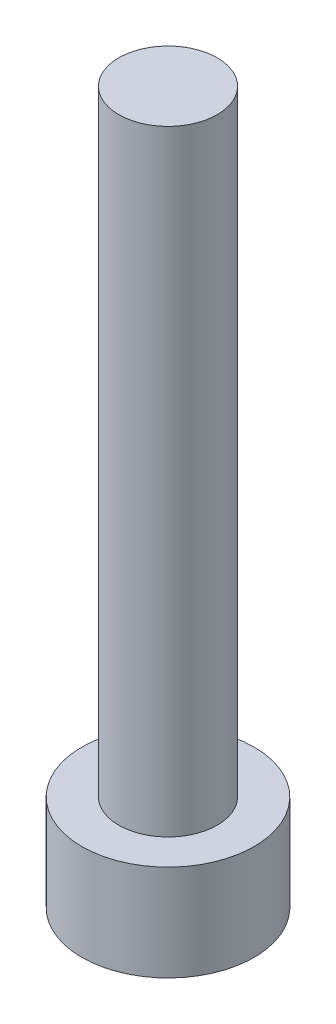
ISO-10303-21;
HEADER;
FILE_DESCRIPTION(('STEP AP214'),'2;1');
FILE_NAME('part.step','',(''),(''),'','','');
FILE_SCHEMA(('AUTOMOTIVE_DESIGN { 1 0 10303 214 1 1 1 1 }'));
ENDSEC;
DATA;
#1=APPLICATION_CONTEXT('core data for automotive mechanical design processes');
#2=APPLICATION_PROTOCOL_DEFINITION('international standard','automotive_design',2000,#1);
#3=PRODUCT_CONTEXT('',#1,'mechanical');
#4=PRODUCT('Part','Part','',(#3));
#5=PRODUCT_RELATED_PRODUCT_CATEGORY('part','',(#4));
#6=PRODUCT_DEFINITION_FORMATION('','',#4);
#7=PRODUCT_DEFINITION_CONTEXT('part definition',#1,'design');
#8=PRODUCT_DEFINITION('design','',#6,#7);
#9=PRODUCT_DEFINITION_SHAPE('','',#8);
#10=(LENGTH_UNIT() NAMED_UNIT(*) SI_UNIT(.MILLI.,.METRE.));
#11=(NAMED_UNIT(*) PLANE_ANGLE_UNIT() SI_UNIT($,.RADIAN.));
#12=(NAMED_UNIT(*) SI_UNIT($,.STERADIAN.) SOLID_ANGLE_UNIT());
#13=UNCERTAINTY_MEASURE_WITH_UNIT(LENGTH_MEASURE(1.E-05),#10,'distance_accuracy_value','');
#14=(GEOMETRIC_REPRESENTATION_CONTEXT(3) GLOBAL_UNCERTAINTY_ASSIGNED_CONTEXT((#13)) GLOBAL_UNIT_ASSIGNED_CONTEXT((#10,
#11,#12)) REPRESENTATION_CONTEXT('',''));
#15=CARTESIAN_POINT('',(0.,0.,0.));
#16=DIRECTION('',(0.,0.,1.));
#17=DIRECTION('',(1.,0.,0.));
#18=AXIS2_PLACEMENT_3D('',#15,#16,#17);
#19=CARTESIAN_POINT('',(0.,3.9,0.));
#20=DIRECTION('',(0.,-1.,0.));
#21=DIRECTION('',(0.,0.,-1.));
#22=AXIS2_PLACEMENT_3D('',#19,#20,#21);
#23=CYLINDRICAL_SURFACE('',#22,3.5);
#24=CARTESIAN_POINT('',(0.,3.9,0.));
#25=DIRECTION('',(0.,1.,0.));
#26=DIRECTION('',(0.,0.,1.));
#27=AXIS2_PLACEMENT_3D('',#24,#25,#26);
#28=CIRCLE('',#27,3.5);
#29=CARTESIAN_POINT('',(0.,3.9,3.5));
#30=VERTEX_POINT('',#29);
#31=EDGE_CURVE('E43',#30,#30,#28,.T.);
#32=ORIENTED_EDGE('',*,*,#31,.F.);
#33=EDGE_LOOP('',(#32));
#34=FACE_BOUND('',#33,.T.);
#35=CARTESIAN_POINT('',(0.,0.,0.));
#36=DIRECTION('',(0.,1.,0.));
#37=DIRECTION('',(0.,0.,1.));
#38=AXIS2_PLACEMENT_3D('',#35,#36,#37);
#39=CIRCLE('',#38,3.5);
#40=CARTESIAN_POINT('',(0.,0.,3.5));
#41=VERTEX_POINT('',#40);
#42=EDGE_CURVE('E38',#41,#41,#39,.T.);
#43=ORIENTED_EDGE('',*,*,#42,.T.);
#44=EDGE_LOOP('',(#43));
#45=FACE_BOUND('',#44,.T.);
#46=ADVANCED_FACE('F35',(#34,#45),#23,.T.);
#47=CARTESIAN_POINT('',(0.,3.9,0.));
#48=DIRECTION('',(0.,1.,0.));
#49=DIRECTION('',(0.,0.,1.));
#50=AXIS2_PLACEMENT_3D('',#47,#48,#49);
#51=PLANE('',#50);
#52=CARTESIAN_POINT('',(0.,3.9,0.));
#53=DIRECTION('',(0.,1.,0.));
#54=DIRECTION('',(0.,0.,1.));
#55=AXIS2_PLACEMENT_3D('',#52,#53,#54);
#56=CIRCLE('',#55,2.);
#57=CARTESIAN_POINT('',(0.,3.9,2.));
#58=VERTEX_POINT('',#57);
#59=EDGE_CURVE('E11',#58,#58,#56,.T.);
#60=ORIENTED_EDGE('',*,*,#59,.F.);
#61=EDGE_LOOP('',(#60));
#62=FACE_BOUND('',#61,.T.);
#63=ORIENTED_EDGE('',*,*,#31,.T.);
#64=EDGE_LOOP('',(#63));
#65=FACE_BOUND('',#64,.T.);
#66=ADVANCED_FACE('F155',(#62,#65),#51,.T.);
#67=CARTESIAN_POINT('',(0.,0.,0.));
#68=DIRECTION('',(0.,1.,0.));
#69=DIRECTION('',(0.,0.,1.));
#70=AXIS2_PLACEMENT_3D('',#67,#68,#69);
#71=PLANE('',#70);
#72=DIRECTION('',(-0.5,0.,0.866025403784438));
#73=VECTOR('',#72,1.);
#74=CARTESIAN_POINT('',(1.725,0.,0.));
#75=LINE('',#74,#73);
#76=CARTESIAN_POINT('',(1.725,0.,0.));
#77=VERTEX_POINT('',#76);
#78=CARTESIAN_POINT('',(0.862499999999999,0.,1.49389382152816));
#79=VERTEX_POINT('',#78);
#80=EDGE_CURVE('E125',#77,#79,#75,.T.);
#81=ORIENTED_EDGE('',*,*,#80,.F.);
#82=DIRECTION('',(0.5,0.,0.866025403784439));
#83=VECTOR('',#82,1.);
#84=CARTESIAN_POINT('',(0.8625,0.,-1.49389382152816));
#85=LINE('',#84,#83);
#86=CARTESIAN_POINT('',(0.8625,0.,-1.49389382152816));
#87=VERTEX_POINT('',#86);
#88=EDGE_CURVE('E51',#87,#77,#85,.T.);
#89=ORIENTED_EDGE('',*,*,#88,.F.);
#90=DIRECTION('',(1.,0.,0.));
#91=VECTOR('',#90,1.);
#92=CARTESIAN_POINT('',(-0.8625,0.,-1.49389382152816));
#93=LINE('',#92,#91);
#94=CARTESIAN_POINT('',(-0.8625,0.,-1.49389382152816));
#95=VERTEX_POINT('',#94);
#96=EDGE_CURVE('E134',#95,#87,#93,.T.);
#97=ORIENTED_EDGE('',*,*,#96,.F.);
#98=DIRECTION('',(0.5,0.,-0.866025403784439));
#99=VECTOR('',#98,1.);
#100=CARTESIAN_POINT('',(-1.725,0.,0.));
#101=LINE('',#100,#99);
#102=CARTESIAN_POINT('',(-1.725,0.,0.));
#103=VERTEX_POINT('',#102);
#104=EDGE_CURVE('E132',#103,#95,#101,.T.);
#105=ORIENTED_EDGE('',*,*,#104,.F.);
#106=DIRECTION('',(-0.5,0.,-0.866025403784439));
#107=VECTOR('',#106,1.);
#108=CARTESIAN_POINT('',(-0.8625,0.,1.49389382152816));
#109=LINE('',#108,#107);
#110=CARTESIAN_POINT('',(-0.8625,0.,1.49389382152816));
#111=VERTEX_POINT('',#110);
#112=EDGE_CURVE('E99',#111,#103,#109,.T.);
#113=ORIENTED_EDGE('',*,*,#112,.F.);
#114=DIRECTION('',(-1.,0.,0.));
#115=VECTOR('',#114,1.);
#116=CARTESIAN_POINT('',(0.862499999999999,0.,1.49389382152816));
#117=LINE('',#116,#115);
#118=EDGE_CURVE('E128',#79,#111,#117,.T.);
#119=ORIENTED_EDGE('',*,*,#118,.F.);
#120=EDGE_LOOP('',(#81,#89,#97,#105,#113,#119));
#121=FACE_BOUND('',#120,.T.);
#122=ORIENTED_EDGE('',*,*,#42,.F.);
#123=EDGE_LOOP('',(#122));
#124=FACE_BOUND('',#123,.T.);
#125=ADVANCED_FACE('F152',(#121,#124),#71,.F.);
#126=CARTESIAN_POINT('',(0.,28.9,0.));
#127=DIRECTION('',(0.,-1.,0.));
#128=DIRECTION('',(0.,0.,-1.));
#129=AXIS2_PLACEMENT_3D('',#126,#127,#128);
#130=CYLINDRICAL_SURFACE('',#129,2.);
#131=CARTESIAN_POINT('',(0.,28.9,0.));
#132=DIRECTION('',(0.,1.,0.));
#133=DIRECTION('',(0.,0.,1.));
#134=AXIS2_PLACEMENT_3D('',#131,#132,#133);
#135=CIRCLE('',#134,2.);
#136=CARTESIAN_POINT('',(0.,28.9,2.));
#137=VERTEX_POINT('',#136);
#138=EDGE_CURVE('E138',#137,#137,#135,.T.);
#139=ORIENTED_EDGE('',*,*,#138,.F.);
#140=EDGE_LOOP('',(#139));
#141=FACE_BOUND('',#140,.T.);
#142=ORIENTED_EDGE('',*,*,#59,.T.);
#143=EDGE_LOOP('',(#142));
#144=FACE_BOUND('',#143,.T.);
#145=ADVANCED_FACE('F154',(#141,#144),#130,.T.);
#146=CARTESIAN_POINT('',(0.,28.9,0.));
#147=DIRECTION('',(0.,1.,0.));
#148=DIRECTION('',(0.,0.,1.));
#149=AXIS2_PLACEMENT_3D('',#146,#147,#148);
#150=PLANE('',#149);
#151=ORIENTED_EDGE('',*,*,#138,.T.);
#152=EDGE_LOOP('',(#151));
#153=FACE_BOUND('',#152,.T.);
#154=ADVANCED_FACE('F161',(#153),#150,.T.);
#155=CARTESIAN_POINT('',(0.8625,2.4,-1.49389382152816));
#156=DIRECTION('',(0.866025403784439,0.,-0.5));
#157=DIRECTION('',(-0.5,0.,-0.866025403784439));
#158=AXIS2_PLACEMENT_3D('',#155,#156,#157);
#159=PLANE('',#158);
#160=ORIENTED_EDGE('',*,*,#88,.T.);
#161=DIRECTION('',(0.,-1.,0.));
#162=VECTOR('',#161,1.);
#163=CARTESIAN_POINT('',(1.725,2.4,0.));
#164=LINE('',#163,#162);
#165=CARTESIAN_POINT('',(1.725,2.4,0.));
#166=VERTEX_POINT('',#165);
#167=EDGE_CURVE('E81',#166,#77,#164,.T.);
#168=ORIENTED_EDGE('',*,*,#167,.F.);
#169=DIRECTION('',(0.5,0.,0.866025403784439));
#170=VECTOR('',#169,1.);
#171=CARTESIAN_POINT('',(0.8625,2.4,-1.49389382152816));
#172=LINE('',#171,#170);
#173=CARTESIAN_POINT('',(0.8625,2.4,-1.49389382152816));
#174=VERTEX_POINT('',#173);
#175=EDGE_CURVE('E136',#174,#166,#172,.T.);
#176=ORIENTED_EDGE('',*,*,#175,.F.);
#177=DIRECTION('',(0.,-1.,0.));
#178=VECTOR('',#177,1.);
#179=CARTESIAN_POINT('',(0.8625,2.4,-1.49389382152816));
#180=LINE('',#179,#178);
#181=EDGE_CURVE('E59',#174,#87,#180,.T.);
#182=ORIENTED_EDGE('',*,*,#181,.T.);
#183=EDGE_LOOP('',(#160,#168,#176,#182));
#184=FACE_BOUND('',#183,.T.);
#185=ADVANCED_FACE('F190',(#184),#159,.F.);
#186=CARTESIAN_POINT('',(-0.8625,2.4,-1.49389382152816));
#187=DIRECTION('',(0.,0.,-1.));
#188=DIRECTION('',(-1.,0.,0.));
#189=AXIS2_PLACEMENT_3D('',#186,#187,#188);
#190=PLANE('',#189);
#191=ORIENTED_EDGE('',*,*,#96,.T.);
#192=ORIENTED_EDGE('',*,*,#181,.F.);
#193=DIRECTION('',(1.,0.,0.));
#194=VECTOR('',#193,1.);
#195=CARTESIAN_POINT('',(-0.8625,2.4,-1.49389382152816));
#196=LINE('',#195,#194);
#197=CARTESIAN_POINT('',(-0.8625,2.4,-1.49389382152816));
#198=VERTEX_POINT('',#197);
#199=EDGE_CURVE('E111',#198,#174,#196,.T.);
#200=ORIENTED_EDGE('',*,*,#199,.F.);
#201=DIRECTION('',(0.,-1.,0.));
#202=VECTOR('',#201,1.);
#203=CARTESIAN_POINT('',(-0.8625,2.4,-1.49389382152816));
#204=LINE('',#203,#202);
#205=EDGE_CURVE('E103',#198,#95,#204,.T.);
#206=ORIENTED_EDGE('',*,*,#205,.T.);
#207=EDGE_LOOP('',(#191,#192,#200,#206));
#208=FACE_BOUND('',#207,.T.);
#209=ADVANCED_FACE('F204',(#208),#190,.F.);
#210=CARTESIAN_POINT('',(-1.725,2.4,0.));
#211=DIRECTION('',(-0.866025403784439,0.,-0.5));
#212=DIRECTION('',(-0.5,0.,0.866025403784439));
#213=AXIS2_PLACEMENT_3D('',#210,#211,#212);
#214=PLANE('',#213);
#215=ORIENTED_EDGE('',*,*,#104,.T.);
#216=ORIENTED_EDGE('',*,*,#205,.F.);
#217=DIRECTION('',(0.5,0.,-0.866025403784439));
#218=VECTOR('',#217,1.);
#219=CARTESIAN_POINT('',(-1.725,2.4,0.));
#220=LINE('',#219,#218);
#221=CARTESIAN_POINT('',(-1.725,2.4,0.));
#222=VERTEX_POINT('',#221);
#223=EDGE_CURVE('E107',#222,#198,#220,.T.);
#224=ORIENTED_EDGE('',*,*,#223,.F.);
#225=DIRECTION('',(0.,-1.,0.));
#226=VECTOR('',#225,1.);
#227=CARTESIAN_POINT('',(-1.725,2.4,0.));
#228=LINE('',#227,#226);
#229=EDGE_CURVE('E92',#222,#103,#228,.T.);
#230=ORIENTED_EDGE('',*,*,#229,.T.);
#231=EDGE_LOOP('',(#215,#216,#224,#230));
#232=FACE_BOUND('',#231,.T.);
#233=ADVANCED_FACE('F108',(#232),#214,.F.);
#234=CARTESIAN_POINT('',(-0.8625,2.4,1.49389382152816));
#235=DIRECTION('',(-0.866025403784439,0.,0.5));
#236=DIRECTION('',(0.5,0.,0.866025403784439));
#237=AXIS2_PLACEMENT_3D('',#234,#235,#236);
#238=PLANE('',#237);
#239=ORIENTED_EDGE('',*,*,#112,.T.);
#240=ORIENTED_EDGE('',*,*,#229,.F.);
#241=DIRECTION('',(-0.5,0.,-0.866025403784439));
#242=VECTOR('',#241,1.);
#243=CARTESIAN_POINT('',(-0.8625,2.4,1.49389382152816));
#244=LINE('',#243,#242);
#245=CARTESIAN_POINT('',(-0.8625,2.4,1.49389382152816));
#246=VERTEX_POINT('',#245);
#247=EDGE_CURVE('E96',#246,#222,#244,.T.);
#248=ORIENTED_EDGE('',*,*,#247,.F.);
#249=DIRECTION('',(0.,-1.,0.));
#250=VECTOR('',#249,1.);
#251=CARTESIAN_POINT('',(-0.8625,2.4,1.49389382152816));
#252=LINE('',#251,#250);
#253=EDGE_CURVE('E104',#246,#111,#252,.T.);
#254=ORIENTED_EDGE('',*,*,#253,.T.);
#255=EDGE_LOOP('',(#239,#240,#248,#254));
#256=FACE_BOUND('',#255,.T.);
#257=ADVANCED_FACE('F94',(#256),#238,.F.);
#258=CARTESIAN_POINT('',(0.862499999999999,2.4,1.49389382152816));
#259=DIRECTION('',(0.,0.,1.));
#260=DIRECTION('',(1.,0.,0.));
#261=AXIS2_PLACEMENT_3D('',#258,#259,#260);
#262=PLANE('',#261);
#263=ORIENTED_EDGE('',*,*,#118,.T.);
#264=ORIENTED_EDGE('',*,*,#253,.F.);
#265=DIRECTION('',(-1.,0.,0.));
#266=VECTOR('',#265,1.);
#267=CARTESIAN_POINT('',(0.862499999999999,2.4,1.49389382152816));
#268=LINE('',#267,#266);
#269=CARTESIAN_POINT('',(0.862499999999999,2.4,1.49389382152816));
#270=VERTEX_POINT('',#269);
#271=EDGE_CURVE('E117',#270,#246,#268,.T.);
#272=ORIENTED_EDGE('',*,*,#271,.F.);
#273=DIRECTION('',(0.,-1.,0.));
#274=VECTOR('',#273,1.);
#275=CARTESIAN_POINT('',(0.862499999999999,2.4,1.49389382152816));
#276=LINE('',#275,#274);
#277=EDGE_CURVE('E141',#270,#79,#276,.T.);
#278=ORIENTED_EDGE('',*,*,#277,.T.);
#279=EDGE_LOOP('',(#263,#264,#272,#278));
#280=FACE_BOUND('',#279,.T.);
#281=ADVANCED_FACE('F229',(#280),#262,.F.);
#282=CARTESIAN_POINT('',(1.725,2.4,0.));
#283=DIRECTION('',(0.866025403784439,0.,0.5));
#284=DIRECTION('',(0.5,0.,-0.866025403784439));
#285=AXIS2_PLACEMENT_3D('',#282,#283,#284);
#286=PLANE('',#285);
#287=ORIENTED_EDGE('',*,*,#80,.T.);
#288=ORIENTED_EDGE('',*,*,#277,.F.);
#289=DIRECTION('',(-0.5,0.,0.866025403784438));
#290=VECTOR('',#289,1.);
#291=CARTESIAN_POINT('',(1.725,2.4,0.));
#292=LINE('',#291,#290);
#293=EDGE_CURVE('E119',#166,#270,#292,.T.);
#294=ORIENTED_EDGE('',*,*,#293,.F.);
#295=ORIENTED_EDGE('',*,*,#167,.T.);
#296=EDGE_LOOP('',(#287,#288,#294,#295));
#297=FACE_BOUND('',#296,.T.);
#298=ADVANCED_FACE('F238',(#297),#286,.F.);
#299=CARTESIAN_POINT('',(0.,2.4,0.));
#300=DIRECTION('',(0.,-1.,0.));
#301=DIRECTION('',(0.,0.,-1.));
#302=AXIS2_PLACEMENT_3D('',#299,#300,#301);
#303=PLANE('',#302);
#304=ORIENTED_EDGE('',*,*,#175,.T.);
#305=ORIENTED_EDGE('',*,*,#293,.T.);
#306=ORIENTED_EDGE('',*,*,#271,.T.);
#307=ORIENTED_EDGE('',*,*,#247,.T.);
#308=ORIENTED_EDGE('',*,*,#223,.T.);
#309=ORIENTED_EDGE('',*,*,#199,.T.);
#310=EDGE_LOOP('',(#304,#305,#306,#307,#308,#309));
#311=FACE_BOUND('',#310,.T.);
#312=ADVANCED_FACE('F114',(#311),#303,.T.);
#313=CLOSED_SHELL('',(#46,#66,#125,#145,#154,#185,#209,#233,#257,#281,#298,#312));
#314=MANIFOLD_SOLID_BREP('B2',#313);
#315=ADVANCED_BREP_SHAPE_REPRESENTATION('',(#18,#314),#14);
#316=SHAPE_DEFINITION_REPRESENTATION(#9,#315);
ENDSEC;
END-ISO-10303-21;
